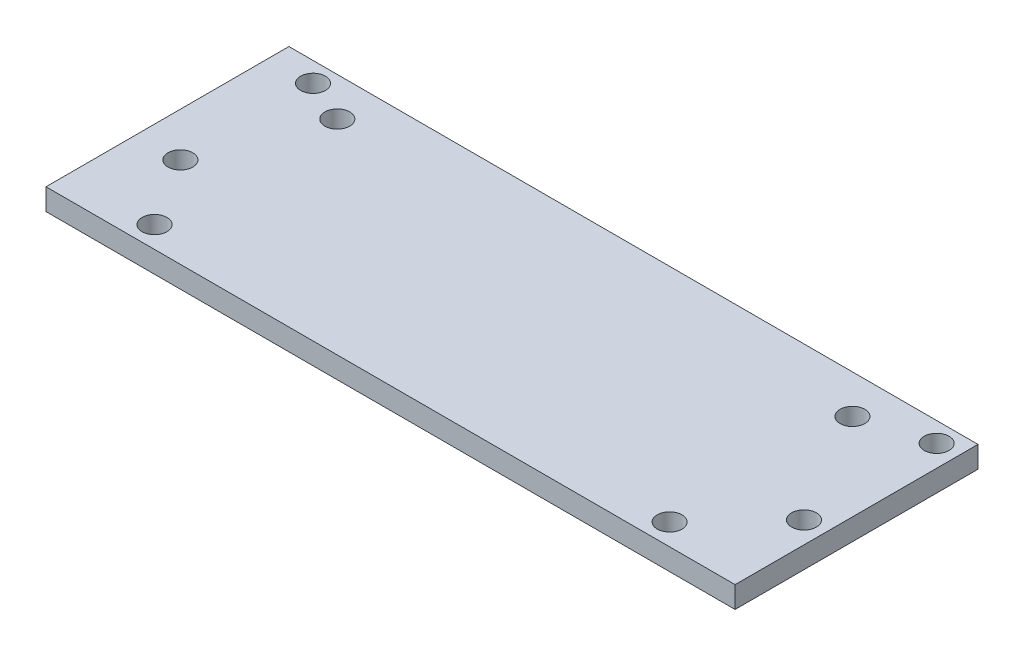
ISO-10303-21;
HEADER;
FILE_DESCRIPTION(('STEP AP214'),'2;1');
FILE_NAME('part.step','',(''),(''),'','','');
FILE_SCHEMA(('AUTOMOTIVE_DESIGN { 1 0 10303 214 1 1 1 1 }'));
ENDSEC;
DATA;
#1=APPLICATION_CONTEXT('core data for automotive mechanical design processes');
#2=APPLICATION_PROTOCOL_DEFINITION('international standard','automotive_design',2000,#1);
#3=PRODUCT_CONTEXT('',#1,'mechanical');
#4=PRODUCT('Part','Part','',(#3));
#5=PRODUCT_RELATED_PRODUCT_CATEGORY('part','',(#4));
#6=PRODUCT_DEFINITION_FORMATION('','',#4);
#7=PRODUCT_DEFINITION_CONTEXT('part definition',#1,'design');
#8=PRODUCT_DEFINITION('design','',#6,#7);
#9=PRODUCT_DEFINITION_SHAPE('','',#8);
#10=(LENGTH_UNIT() NAMED_UNIT(*) SI_UNIT(.MILLI.,.METRE.));
#11=(NAMED_UNIT(*) PLANE_ANGLE_UNIT() SI_UNIT($,.RADIAN.));
#12=(NAMED_UNIT(*) SI_UNIT($,.STERADIAN.) SOLID_ANGLE_UNIT());
#13=UNCERTAINTY_MEASURE_WITH_UNIT(LENGTH_MEASURE(1.E-05),#10,'distance_accuracy_value','');
#14=(GEOMETRIC_REPRESENTATION_CONTEXT(3) GLOBAL_UNCERTAINTY_ASSIGNED_CONTEXT((#13)) GLOBAL_UNIT_ASSIGNED_CONTEXT((#10,
#11,#12)) REPRESENTATION_CONTEXT('',''));
#15=CARTESIAN_POINT('',(0.,0.,0.));
#16=DIRECTION('',(0.,0.,1.));
#17=DIRECTION('',(1.,0.,0.));
#18=AXIS2_PLACEMENT_3D('',#15,#16,#17);
#19=CARTESIAN_POINT('',(-50.8,3.175,17.907));
#20=DIRECTION('',(1.,0.,0.));
#21=DIRECTION('',(0.,0.,-1.));
#22=AXIS2_PLACEMENT_3D('',#19,#20,#21);
#23=PLANE('',#22);
#24=DIRECTION('',(0.,0.,1.));
#25=VECTOR('',#24,1.);
#26=CARTESIAN_POINT('',(-50.8,0.,17.907));
#27=LINE('',#26,#25);
#28=CARTESIAN_POINT('',(-50.8,0.,-17.907));
#29=VERTEX_POINT('',#28);
#30=CARTESIAN_POINT('',(-50.8,0.,17.907));
#31=VERTEX_POINT('',#30);
#32=EDGE_CURVE('E96',#29,#31,#27,.T.);
#33=ORIENTED_EDGE('',*,*,#32,.T.);
#34=DIRECTION('',(0.,-1.,0.));
#35=VECTOR('',#34,1.);
#36=CARTESIAN_POINT('',(-50.8,3.175,17.907));
#37=LINE('',#36,#35);
#38=CARTESIAN_POINT('',(-50.8,3.175,17.907));
#39=VERTEX_POINT('',#38);
#40=EDGE_CURVE('E11',#39,#31,#37,.T.);
#41=ORIENTED_EDGE('',*,*,#40,.F.);
#42=DIRECTION('',(0.,0.,1.));
#43=VECTOR('',#42,1.);
#44=CARTESIAN_POINT('',(-50.8,3.175,17.907));
#45=LINE('',#44,#43);
#46=CARTESIAN_POINT('',(-50.8,3.175,-17.907));
#47=VERTEX_POINT('',#46);
#48=EDGE_CURVE('E84',#47,#39,#45,.T.);
#49=ORIENTED_EDGE('',*,*,#48,.F.);
#50=DIRECTION('',(0.,-1.,0.));
#51=VECTOR('',#50,1.);
#52=CARTESIAN_POINT('',(-50.8,3.175,-17.907));
#53=LINE('',#52,#51);
#54=EDGE_CURVE('E92',#47,#29,#53,.T.);
#55=ORIENTED_EDGE('',*,*,#54,.T.);
#56=EDGE_LOOP('',(#33,#41,#49,#55));
#57=FACE_BOUND('',#56,.T.);
#58=ADVANCED_FACE('F33',(#57),#23,.F.);
#59=CARTESIAN_POINT('',(50.8,3.175,17.907));
#60=DIRECTION('',(0.,0.,-1.));
#61=DIRECTION('',(-1.,0.,0.));
#62=AXIS2_PLACEMENT_3D('',#59,#60,#61);
#63=PLANE('',#62);
#64=DIRECTION('',(1.,0.,0.));
#65=VECTOR('',#64,1.);
#66=CARTESIAN_POINT('',(50.8,0.,17.907));
#67=LINE('',#66,#65);
#68=CARTESIAN_POINT('',(50.8,0.,17.907));
#69=VERTEX_POINT('',#68);
#70=EDGE_CURVE('E88',#31,#69,#67,.T.);
#71=ORIENTED_EDGE('',*,*,#70,.T.);
#72=DIRECTION('',(0.,-1.,0.));
#73=VECTOR('',#72,1.);
#74=CARTESIAN_POINT('',(50.8,3.175,17.907));
#75=LINE('',#74,#73);
#76=CARTESIAN_POINT('',(50.8,3.175,17.907));
#77=VERTEX_POINT('',#76);
#78=EDGE_CURVE('E41',#77,#69,#75,.T.);
#79=ORIENTED_EDGE('',*,*,#78,.F.);
#80=DIRECTION('',(1.,0.,0.));
#81=VECTOR('',#80,1.);
#82=CARTESIAN_POINT('',(50.8,3.175,17.907));
#83=LINE('',#82,#81);
#84=EDGE_CURVE('E79',#39,#77,#83,.T.);
#85=ORIENTED_EDGE('',*,*,#84,.F.);
#86=ORIENTED_EDGE('',*,*,#40,.T.);
#87=EDGE_LOOP('',(#71,#79,#85,#86));
#88=FACE_BOUND('',#87,.T.);
#89=ADVANCED_FACE('F87',(#88),#63,.F.);
#90=CARTESIAN_POINT('',(50.8,3.175,17.907));
#91=DIRECTION('',(-1.,0.,0.));
#92=DIRECTION('',(0.,0.,1.));
#93=AXIS2_PLACEMENT_3D('',#90,#91,#92);
#94=PLANE('',#93);
#95=DIRECTION('',(0.,0.,-1.));
#96=VECTOR('',#95,1.);
#97=CARTESIAN_POINT('',(50.8,0.,17.907));
#98=LINE('',#97,#96);
#99=CARTESIAN_POINT('',(50.8,0.,-17.907));
#100=VERTEX_POINT('',#99);
#101=EDGE_CURVE('E66',#69,#100,#98,.T.);
#102=ORIENTED_EDGE('',*,*,#101,.T.);
#103=DIRECTION('',(0.,-1.,0.));
#104=VECTOR('',#103,1.);
#105=CARTESIAN_POINT('',(50.8,3.175,-17.907));
#106=LINE('',#105,#104);
#107=CARTESIAN_POINT('',(50.8,3.175,-17.907));
#108=VERTEX_POINT('',#107);
#109=EDGE_CURVE('E89',#108,#100,#106,.T.);
#110=ORIENTED_EDGE('',*,*,#109,.F.);
#111=DIRECTION('',(0.,0.,-1.));
#112=VECTOR('',#111,1.);
#113=CARTESIAN_POINT('',(50.8,3.175,17.907));
#114=LINE('',#113,#112);
#115=EDGE_CURVE('E82',#77,#108,#114,.T.);
#116=ORIENTED_EDGE('',*,*,#115,.F.);
#117=ORIENTED_EDGE('',*,*,#78,.T.);
#118=EDGE_LOOP('',(#102,#110,#116,#117));
#119=FACE_BOUND('',#118,.T.);
#120=ADVANCED_FACE('F90',(#119),#94,.F.);
#121=CARTESIAN_POINT('',(50.8,3.175,-17.907));
#122=DIRECTION('',(0.,0.,1.));
#123=DIRECTION('',(1.,0.,0.));
#124=AXIS2_PLACEMENT_3D('',#121,#122,#123);
#125=PLANE('',#124);
#126=DIRECTION('',(-1.,0.,0.));
#127=VECTOR('',#126,1.);
#128=CARTESIAN_POINT('',(50.8,0.,-17.907));
#129=LINE('',#128,#127);
#130=EDGE_CURVE('E72',#100,#29,#129,.T.);
#131=ORIENTED_EDGE('',*,*,#130,.T.);
#132=ORIENTED_EDGE('',*,*,#54,.F.);
#133=DIRECTION('',(-1.,0.,0.));
#134=VECTOR('',#133,1.);
#135=CARTESIAN_POINT('',(50.8,3.175,-17.907));
#136=LINE('',#135,#134);
#137=EDGE_CURVE('E49',#108,#47,#136,.T.);
#138=ORIENTED_EDGE('',*,*,#137,.F.);
#139=ORIENTED_EDGE('',*,*,#109,.T.);
#140=EDGE_LOOP('',(#131,#132,#138,#139));
#141=FACE_BOUND('',#140,.T.);
#142=ADVANCED_FACE('F104',(#141),#125,.F.);
#143=CARTESIAN_POINT('',(0.,3.175,0.));
#144=DIRECTION('',(0.,1.,0.));
#145=DIRECTION('',(0.,0.,1.));
#146=AXIS2_PLACEMENT_3D('',#143,#144,#145);
#147=PLANE('',#146);
#148=CARTESIAN_POINT('',(37.973,3.175,-12.2174));
#149=DIRECTION('',(0.,1.,0.));
#150=DIRECTION('',(0.,0.,-1.));
#151=AXIS2_PLACEMENT_3D('',#148,#149,#150);
#152=CIRCLE('',#151,1.8288);
#153=CARTESIAN_POINT('',(37.973,3.175,-14.0462));
#154=VERTEX_POINT('',#153);
#155=EDGE_CURVE('E152',#154,#154,#152,.T.);
#156=ORIENTED_EDGE('',*,*,#155,.F.);
#157=EDGE_LOOP('',(#156));
#158=FACE_BOUND('',#157,.T.);
#159=CARTESIAN_POINT('',(37.973,3.175,14.732));
#160=DIRECTION('',(0.,1.,0.));
#161=DIRECTION('',(0.,0.,-1.));
#162=AXIS2_PLACEMENT_3D('',#159,#160,#161);
#163=CIRCLE('',#162,1.8288);
#164=CARTESIAN_POINT('',(37.973,3.175,12.9032));
#165=VERTEX_POINT('',#164);
#166=EDGE_CURVE('E146',#165,#165,#163,.T.);
#167=ORIENTED_EDGE('',*,*,#166,.F.);
#168=EDGE_LOOP('',(#167));
#169=FACE_BOUND('',#168,.T.);
#170=CARTESIAN_POINT('',(-37.973,3.175,-12.2174));
#171=DIRECTION('',(0.,1.,0.));
#172=DIRECTION('',(0.,0.,1.));
#173=AXIS2_PLACEMENT_3D('',#170,#171,#172);
#174=CIRCLE('',#173,1.8288);
#175=CARTESIAN_POINT('',(-37.973,3.175,-10.3886));
#176=VERTEX_POINT('',#175);
#177=EDGE_CURVE('E140',#176,#176,#174,.T.);
#178=ORIENTED_EDGE('',*,*,#177,.F.);
#179=EDGE_LOOP('',(#178));
#180=FACE_BOUND('',#179,.T.);
#181=CARTESIAN_POINT('',(-37.973,3.175,14.732));
#182=DIRECTION('',(0.,1.,0.));
#183=DIRECTION('',(0.,0.,1.));
#184=AXIS2_PLACEMENT_3D('',#181,#182,#183);
#185=CIRCLE('',#184,1.8288);
#186=CARTESIAN_POINT('',(-37.973,3.175,16.5608));
#187=VERTEX_POINT('',#186);
#188=EDGE_CURVE('E134',#187,#187,#185,.T.);
#189=ORIENTED_EDGE('',*,*,#188,.F.);
#190=EDGE_LOOP('',(#189));
#191=FACE_BOUND('',#190,.T.);
#192=CARTESIAN_POINT('',(-44.323,3.175,4.572));
#193=DIRECTION('',(0.,1.,0.));
#194=DIRECTION('',(0.,0.,1.));
#195=AXIS2_PLACEMENT_3D('',#192,#193,#194);
#196=CIRCLE('',#195,1.8288);
#197=CARTESIAN_POINT('',(-44.323,3.175,6.40079999999999));
#198=VERTEX_POINT('',#197);
#199=EDGE_CURVE('E128',#198,#198,#196,.T.);
#200=ORIENTED_EDGE('',*,*,#199,.F.);
#201=EDGE_LOOP('',(#200));
#202=FACE_BOUND('',#201,.T.);
#203=CARTESIAN_POINT('',(-44.323,3.175,-14.986));
#204=DIRECTION('',(0.,1.,0.));
#205=DIRECTION('',(0.,0.,1.));
#206=AXIS2_PLACEMENT_3D('',#203,#204,#205);
#207=CIRCLE('',#206,1.8288);
#208=CARTESIAN_POINT('',(-44.323,3.175,-13.1572));
#209=VERTEX_POINT('',#208);
#210=EDGE_CURVE('E122',#209,#209,#207,.T.);
#211=ORIENTED_EDGE('',*,*,#210,.F.);
#212=EDGE_LOOP('',(#211));
#213=FACE_BOUND('',#212,.T.);
#214=CARTESIAN_POINT('',(47.625,3.175,4.572));
#215=DIRECTION('',(0.,1.,0.));
#216=DIRECTION('',(0.,0.,1.));
#217=AXIS2_PLACEMENT_3D('',#214,#215,#216);
#218=CIRCLE('',#217,1.8288);
#219=CARTESIAN_POINT('',(47.625,3.175,6.40079999999999));
#220=VERTEX_POINT('',#219);
#221=EDGE_CURVE('E116',#220,#220,#218,.T.);
#222=ORIENTED_EDGE('',*,*,#221,.F.);
#223=EDGE_LOOP('',(#222));
#224=FACE_BOUND('',#223,.T.);
#225=CARTESIAN_POINT('',(47.625,3.175,-14.986));
#226=DIRECTION('',(0.,1.,0.));
#227=DIRECTION('',(0.,0.,1.));
#228=AXIS2_PLACEMENT_3D('',#225,#226,#227);
#229=CIRCLE('',#228,1.82880000000001);
#230=CARTESIAN_POINT('',(47.625,3.175,-13.1572));
#231=VERTEX_POINT('',#230);
#232=EDGE_CURVE('E110',#231,#231,#229,.T.);
#233=ORIENTED_EDGE('',*,*,#232,.F.);
#234=EDGE_LOOP('',(#233));
#235=FACE_BOUND('',#234,.T.);
#236=ORIENTED_EDGE('',*,*,#48,.T.);
#237=ORIENTED_EDGE('',*,*,#84,.T.);
#238=ORIENTED_EDGE('',*,*,#115,.T.);
#239=ORIENTED_EDGE('',*,*,#137,.T.);
#240=EDGE_LOOP('',(#236,#237,#238,#239));
#241=FACE_BOUND('',#240,.T.);
#242=ADVANCED_FACE('F80',(#158,#169,#180,#191,#202,#213,#224,#235,#241),#147,.T.);
#243=CARTESIAN_POINT('',(0.,0.,0.));
#244=DIRECTION('',(0.,1.,0.));
#245=DIRECTION('',(0.,0.,1.));
#246=AXIS2_PLACEMENT_3D('',#243,#244,#245);
#247=PLANE('',#246);
#248=CARTESIAN_POINT('',(37.973,0.,-12.2174));
#249=DIRECTION('',(0.,1.,0.));
#250=DIRECTION('',(0.,0.,-1.));
#251=AXIS2_PLACEMENT_3D('',#248,#249,#250);
#252=CIRCLE('',#251,1.8288);
#253=CARTESIAN_POINT('',(37.973,0.,-14.0462));
#254=VERTEX_POINT('',#253);
#255=EDGE_CURVE('E149',#254,#254,#252,.T.);
#256=ORIENTED_EDGE('',*,*,#255,.T.);
#257=EDGE_LOOP('',(#256));
#258=FACE_BOUND('',#257,.T.);
#259=CARTESIAN_POINT('',(37.973,0.,14.732));
#260=DIRECTION('',(0.,1.,0.));
#261=DIRECTION('',(0.,0.,-1.));
#262=AXIS2_PLACEMENT_3D('',#259,#260,#261);
#263=CIRCLE('',#262,1.8288);
#264=CARTESIAN_POINT('',(37.973,0.,12.9032));
#265=VERTEX_POINT('',#264);
#266=EDGE_CURVE('E143',#265,#265,#263,.T.);
#267=ORIENTED_EDGE('',*,*,#266,.T.);
#268=EDGE_LOOP('',(#267));
#269=FACE_BOUND('',#268,.T.);
#270=CARTESIAN_POINT('',(-37.973,0.,-12.2174));
#271=DIRECTION('',(0.,1.,0.));
#272=DIRECTION('',(0.,0.,1.));
#273=AXIS2_PLACEMENT_3D('',#270,#271,#272);
#274=CIRCLE('',#273,1.8288);
#275=CARTESIAN_POINT('',(-37.973,0.,-10.3886));
#276=VERTEX_POINT('',#275);
#277=EDGE_CURVE('E137',#276,#276,#274,.T.);
#278=ORIENTED_EDGE('',*,*,#277,.T.);
#279=EDGE_LOOP('',(#278));
#280=FACE_BOUND('',#279,.T.);
#281=CARTESIAN_POINT('',(-37.973,0.,14.732));
#282=DIRECTION('',(0.,1.,0.));
#283=DIRECTION('',(0.,0.,1.));
#284=AXIS2_PLACEMENT_3D('',#281,#282,#283);
#285=CIRCLE('',#284,1.8288);
#286=CARTESIAN_POINT('',(-37.973,0.,16.5608));
#287=VERTEX_POINT('',#286);
#288=EDGE_CURVE('E131',#287,#287,#285,.T.);
#289=ORIENTED_EDGE('',*,*,#288,.T.);
#290=EDGE_LOOP('',(#289));
#291=FACE_BOUND('',#290,.T.);
#292=CARTESIAN_POINT('',(-44.323,0.,4.572));
#293=DIRECTION('',(0.,1.,0.));
#294=DIRECTION('',(0.,0.,1.));
#295=AXIS2_PLACEMENT_3D('',#292,#293,#294);
#296=CIRCLE('',#295,1.8288);
#297=CARTESIAN_POINT('',(-44.323,0.,6.40079999999999));
#298=VERTEX_POINT('',#297);
#299=EDGE_CURVE('E125',#298,#298,#296,.T.);
#300=ORIENTED_EDGE('',*,*,#299,.T.);
#301=EDGE_LOOP('',(#300));
#302=FACE_BOUND('',#301,.T.);
#303=CARTESIAN_POINT('',(-44.323,0.,-14.986));
#304=DIRECTION('',(0.,1.,0.));
#305=DIRECTION('',(0.,0.,1.));
#306=AXIS2_PLACEMENT_3D('',#303,#304,#305);
#307=CIRCLE('',#306,1.8288);
#308=CARTESIAN_POINT('',(-44.323,0.,-13.1572));
#309=VERTEX_POINT('',#308);
#310=EDGE_CURVE('E119',#309,#309,#307,.T.);
#311=ORIENTED_EDGE('',*,*,#310,.T.);
#312=EDGE_LOOP('',(#311));
#313=FACE_BOUND('',#312,.T.);
#314=CARTESIAN_POINT('',(47.625,0.,4.572));
#315=DIRECTION('',(0.,1.,0.));
#316=DIRECTION('',(0.,0.,1.));
#317=AXIS2_PLACEMENT_3D('',#314,#315,#316);
#318=CIRCLE('',#317,1.8288);
#319=CARTESIAN_POINT('',(47.625,0.,6.40079999999999));
#320=VERTEX_POINT('',#319);
#321=EDGE_CURVE('E113',#320,#320,#318,.T.);
#322=ORIENTED_EDGE('',*,*,#321,.T.);
#323=EDGE_LOOP('',(#322));
#324=FACE_BOUND('',#323,.T.);
#325=CARTESIAN_POINT('',(47.625,0.,-14.986));
#326=DIRECTION('',(0.,1.,0.));
#327=DIRECTION('',(0.,0.,1.));
#328=AXIS2_PLACEMENT_3D('',#325,#326,#327);
#329=CIRCLE('',#328,1.82880000000001);
#330=CARTESIAN_POINT('',(47.625,0.,-13.1572));
#331=VERTEX_POINT('',#330);
#332=EDGE_CURVE('E99',#331,#331,#329,.T.);
#333=ORIENTED_EDGE('',*,*,#332,.T.);
#334=EDGE_LOOP('',(#333));
#335=FACE_BOUND('',#334,.T.);
#336=ORIENTED_EDGE('',*,*,#32,.F.);
#337=ORIENTED_EDGE('',*,*,#130,.F.);
#338=ORIENTED_EDGE('',*,*,#101,.F.);
#339=ORIENTED_EDGE('',*,*,#70,.F.);
#340=EDGE_LOOP('',(#336,#337,#338,#339));
#341=FACE_BOUND('',#340,.T.);
#342=ADVANCED_FACE('F107',(#258,#269,#280,#291,#302,#313,#324,#335,#341),#247,.F.);
#343=CARTESIAN_POINT('',(47.625,0.,-14.986));
#344=DIRECTION('',(0.,1.,0.));
#345=DIRECTION('',(0.,0.,1.));
#346=AXIS2_PLACEMENT_3D('',#343,#344,#345);
#347=CYLINDRICAL_SURFACE('',#346,1.82880000000001);
#348=ORIENTED_EDGE('',*,*,#332,.F.);
#349=EDGE_LOOP('',(#348));
#350=FACE_BOUND('',#349,.T.);
#351=ORIENTED_EDGE('',*,*,#232,.T.);
#352=EDGE_LOOP('',(#351));
#353=FACE_BOUND('',#352,.T.);
#354=ADVANCED_FACE('F184',(#350,#353),#347,.F.);
#355=CARTESIAN_POINT('',(47.625,0.,4.572));
#356=DIRECTION('',(0.,1.,0.));
#357=DIRECTION('',(0.,0.,1.));
#358=AXIS2_PLACEMENT_3D('',#355,#356,#357);
#359=CYLINDRICAL_SURFACE('',#358,1.8288);
#360=ORIENTED_EDGE('',*,*,#321,.F.);
#361=EDGE_LOOP('',(#360));
#362=FACE_BOUND('',#361,.T.);
#363=ORIENTED_EDGE('',*,*,#221,.T.);
#364=EDGE_LOOP('',(#363));
#365=FACE_BOUND('',#364,.T.);
#366=ADVANCED_FACE('F186',(#362,#365),#359,.F.);
#367=CARTESIAN_POINT('',(-44.323,0.,-14.986));
#368=DIRECTION('',(0.,1.,0.));
#369=DIRECTION('',(0.,0.,1.));
#370=AXIS2_PLACEMENT_3D('',#367,#368,#369);
#371=CYLINDRICAL_SURFACE('',#370,1.8288);
#372=ORIENTED_EDGE('',*,*,#310,.F.);
#373=EDGE_LOOP('',(#372));
#374=FACE_BOUND('',#373,.T.);
#375=ORIENTED_EDGE('',*,*,#210,.T.);
#376=EDGE_LOOP('',(#375));
#377=FACE_BOUND('',#376,.T.);
#378=ADVANCED_FACE('F193',(#374,#377),#371,.F.);
#379=CARTESIAN_POINT('',(-44.323,0.,4.572));
#380=DIRECTION('',(0.,1.,0.));
#381=DIRECTION('',(0.,0.,1.));
#382=AXIS2_PLACEMENT_3D('',#379,#380,#381);
#383=CYLINDRICAL_SURFACE('',#382,1.8288);
#384=ORIENTED_EDGE('',*,*,#299,.F.);
#385=EDGE_LOOP('',(#384));
#386=FACE_BOUND('',#385,.T.);
#387=ORIENTED_EDGE('',*,*,#199,.T.);
#388=EDGE_LOOP('',(#387));
#389=FACE_BOUND('',#388,.T.);
#390=ADVANCED_FACE('F233',(#386,#389),#383,.F.);
#391=CARTESIAN_POINT('',(-37.973,0.,14.732));
#392=DIRECTION('',(0.,1.,0.));
#393=DIRECTION('',(0.,0.,1.));
#394=AXIS2_PLACEMENT_3D('',#391,#392,#393);
#395=CYLINDRICAL_SURFACE('',#394,1.8288);
#396=ORIENTED_EDGE('',*,*,#288,.F.);
#397=EDGE_LOOP('',(#396));
#398=FACE_BOUND('',#397,.T.);
#399=ORIENTED_EDGE('',*,*,#188,.T.);
#400=EDGE_LOOP('',(#399));
#401=FACE_BOUND('',#400,.T.);
#402=ADVANCED_FACE('F227',(#398,#401),#395,.F.);
#403=CARTESIAN_POINT('',(-37.973,0.,-12.2174));
#404=DIRECTION('',(0.,1.,0.));
#405=DIRECTION('',(0.,0.,1.));
#406=AXIS2_PLACEMENT_3D('',#403,#404,#405);
#407=CYLINDRICAL_SURFACE('',#406,1.8288);
#408=ORIENTED_EDGE('',*,*,#277,.F.);
#409=EDGE_LOOP('',(#408));
#410=FACE_BOUND('',#409,.T.);
#411=ORIENTED_EDGE('',*,*,#177,.T.);
#412=EDGE_LOOP('',(#411));
#413=FACE_BOUND('',#412,.T.);
#414=ADVANCED_FACE('F232',(#410,#413),#407,.F.);
#415=CARTESIAN_POINT('',(37.973,0.,14.732));
#416=DIRECTION('',(0.,1.,0.));
#417=DIRECTION('',(0.,0.,1.));
#418=AXIS2_PLACEMENT_3D('',#415,#416,#417);
#419=CYLINDRICAL_SURFACE('',#418,1.8288);
#420=ORIENTED_EDGE('',*,*,#266,.F.);
#421=EDGE_LOOP('',(#420));
#422=FACE_BOUND('',#421,.T.);
#423=ORIENTED_EDGE('',*,*,#166,.T.);
#424=EDGE_LOOP('',(#423));
#425=FACE_BOUND('',#424,.T.);
#426=ADVANCED_FACE('F163',(#422,#425),#419,.F.);
#427=CARTESIAN_POINT('',(37.973,0.,-12.2174));
#428=DIRECTION('',(0.,1.,0.));
#429=DIRECTION('',(0.,0.,1.));
#430=AXIS2_PLACEMENT_3D('',#427,#428,#429);
#431=CYLINDRICAL_SURFACE('',#430,1.8288);
#432=ORIENTED_EDGE('',*,*,#255,.F.);
#433=EDGE_LOOP('',(#432));
#434=FACE_BOUND('',#433,.T.);
#435=ORIENTED_EDGE('',*,*,#155,.T.);
#436=EDGE_LOOP('',(#435));
#437=FACE_BOUND('',#436,.T.);
#438=ADVANCED_FACE('F160',(#434,#437),#431,.F.);
#439=CLOSED_SHELL('',(#58,#89,#120,#142,#242,#342,#354,#366,#378,#390,#402,#414,#426,#438));
#440=MANIFOLD_SOLID_BREP('B2',#439);
#441=ADVANCED_BREP_SHAPE_REPRESENTATION('',(#18,#440),#14);
#442=SHAPE_DEFINITION_REPRESENTATION(#9,#441);
ENDSEC;
END-ISO-10303-21;
